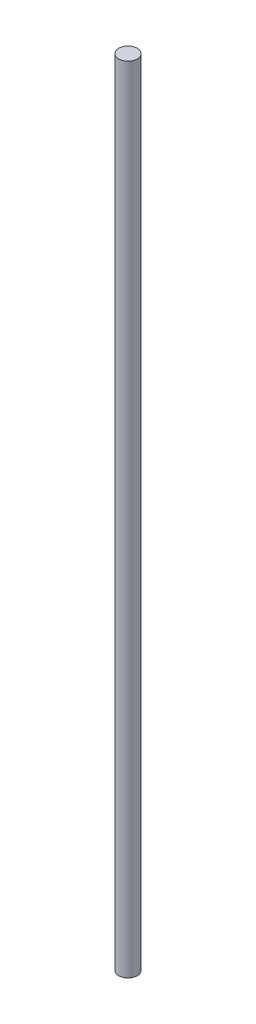
ISO-10303-21;
HEADER;
FILE_DESCRIPTION(('STEP AP214'),'2;1');
FILE_NAME('part.step','',(''),(''),'','','');
FILE_SCHEMA(('AUTOMOTIVE_DESIGN { 1 0 10303 214 1 1 1 1 }'));
ENDSEC;
DATA;
#1=APPLICATION_CONTEXT('core data for automotive mechanical design processes');
#2=APPLICATION_PROTOCOL_DEFINITION('international standard','automotive_design',2000,#1);
#3=PRODUCT_CONTEXT('',#1,'mechanical');
#4=PRODUCT('Part','Part','',(#3));
#5=PRODUCT_RELATED_PRODUCT_CATEGORY('part','',(#4));
#6=PRODUCT_DEFINITION_FORMATION('','',#4);
#7=PRODUCT_DEFINITION_CONTEXT('part definition',#1,'design');
#8=PRODUCT_DEFINITION('design','',#6,#7);
#9=PRODUCT_DEFINITION_SHAPE('','',#8);
#10=(LENGTH_UNIT() NAMED_UNIT(*) SI_UNIT(.MILLI.,.METRE.));
#11=(NAMED_UNIT(*) PLANE_ANGLE_UNIT() SI_UNIT($,.RADIAN.));
#12=(NAMED_UNIT(*) SI_UNIT($,.STERADIAN.) SOLID_ANGLE_UNIT());
#13=UNCERTAINTY_MEASURE_WITH_UNIT(LENGTH_MEASURE(1.E-05),#10,'distance_accuracy_value','');
#14=(GEOMETRIC_REPRESENTATION_CONTEXT(3) GLOBAL_UNCERTAINTY_ASSIGNED_CONTEXT((#13)) GLOBAL_UNIT_ASSIGNED_CONTEXT((#10,
#11,#12)) REPRESENTATION_CONTEXT('',''));
#15=CARTESIAN_POINT('',(0.,0.,0.));
#16=DIRECTION('',(0.,0.,1.));
#17=DIRECTION('',(1.,0.,0.));
#18=AXIS2_PLACEMENT_3D('',#15,#16,#17);
#19=CARTESIAN_POINT('',(0.,203.2,0.));
#20=DIRECTION('',(0.,-1.,0.));
#21=DIRECTION('',(0.,0.,-1.));
#22=AXIS2_PLACEMENT_3D('',#19,#20,#21);
#23=CYLINDRICAL_SURFACE('',#22,2.38125);
#24=CARTESIAN_POINT('',(0.,203.2,0.));
#25=DIRECTION('',(0.,1.,0.));
#26=DIRECTION('',(0.,0.,1.));
#27=AXIS2_PLACEMENT_3D('',#24,#25,#26);
#28=CIRCLE('',#27,2.38125);
#29=CARTESIAN_POINT('',(0.,203.2,2.38125));
#30=VERTEX_POINT('',#29);
#31=EDGE_CURVE('E10',#30,#30,#28,.T.);
#32=ORIENTED_EDGE('',*,*,#31,.F.);
#33=EDGE_LOOP('',(#32));
#34=FACE_BOUND('',#33,.T.);
#35=CARTESIAN_POINT('',(0.,0.,0.));
#36=DIRECTION('',(0.,1.,0.));
#37=DIRECTION('',(0.,0.,1.));
#38=AXIS2_PLACEMENT_3D('',#35,#36,#37);
#39=CIRCLE('',#38,2.38125);
#40=CARTESIAN_POINT('',(0.,0.,2.38125));
#41=VERTEX_POINT('',#40);
#42=EDGE_CURVE('E34',#41,#41,#39,.T.);
#43=ORIENTED_EDGE('',*,*,#42,.T.);
#44=EDGE_LOOP('',(#43));
#45=FACE_BOUND('',#44,.T.);
#46=ADVANCED_FACE('F31',(#34,#45),#23,.T.);
#47=CARTESIAN_POINT('',(0.,203.2,0.));
#48=DIRECTION('',(0.,1.,0.));
#49=DIRECTION('',(0.,0.,1.));
#50=AXIS2_PLACEMENT_3D('',#47,#48,#49);
#51=PLANE('',#50);
#52=ORIENTED_EDGE('',*,*,#31,.T.);
#53=EDGE_LOOP('',(#52));
#54=FACE_BOUND('',#53,.T.);
#55=ADVANCED_FACE('F46',(#54),#51,.T.);
#56=CARTESIAN_POINT('',(0.,0.,0.));
#57=DIRECTION('',(0.,1.,0.));
#58=DIRECTION('',(0.,0.,1.));
#59=AXIS2_PLACEMENT_3D('',#56,#57,#58);
#60=PLANE('',#59);
#61=ORIENTED_EDGE('',*,*,#42,.F.);
#62=EDGE_LOOP('',(#61));
#63=FACE_BOUND('',#62,.T.);
#64=ADVANCED_FACE('F44',(#63),#60,.F.);
#65=CLOSED_SHELL('',(#46,#55,#64));
#66=MANIFOLD_SOLID_BREP('B2',#65);
#67=ADVANCED_BREP_SHAPE_REPRESENTATION('',(#18,#66),#14);
#68=SHAPE_DEFINITION_REPRESENTATION(#9,#67);
ENDSEC;
END-ISO-10303-21;
